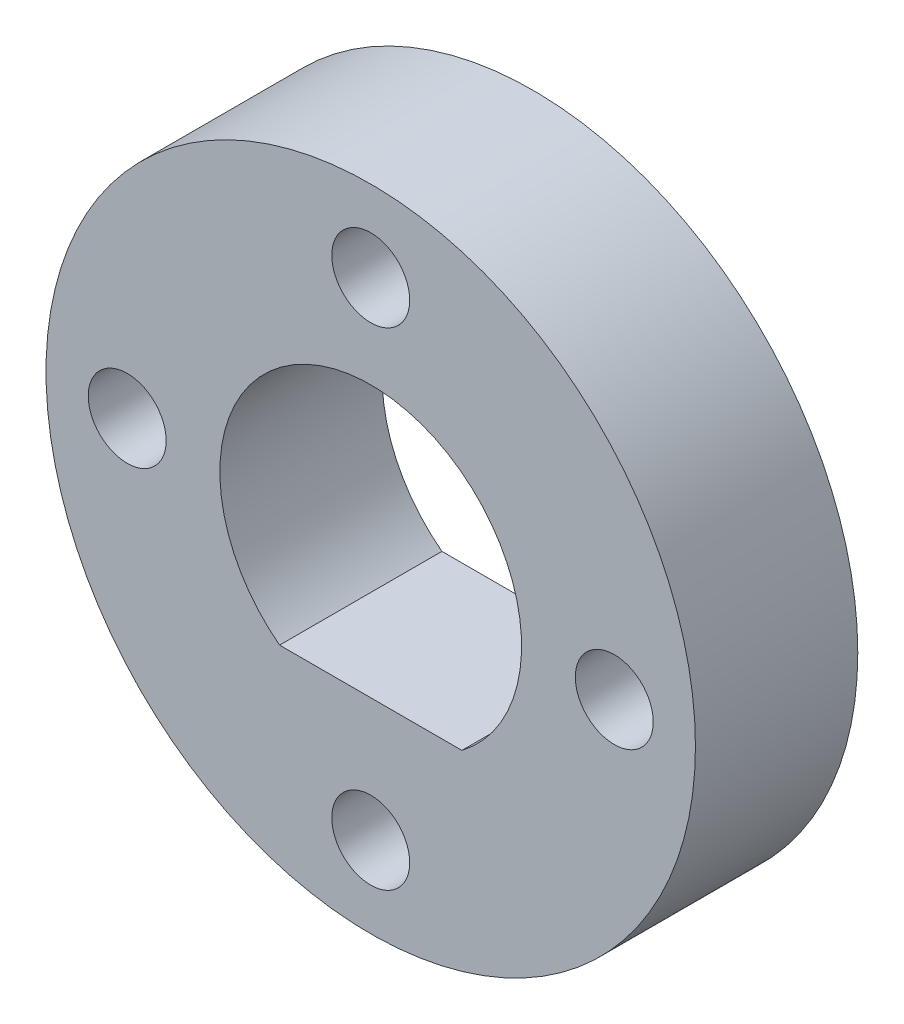
ISO-10303-21;
HEADER;
FILE_DESCRIPTION(('STEP AP214'),'2;1');
FILE_NAME('part.step','',(''),(''),'','','');
FILE_SCHEMA(('AUTOMOTIVE_DESIGN { 1 0 10303 214 1 1 1 1 }'));
ENDSEC;
DATA;
#1=APPLICATION_CONTEXT('core data for automotive mechanical design processes');
#2=APPLICATION_PROTOCOL_DEFINITION('international standard','automotive_design',2000,#1);
#3=PRODUCT_CONTEXT('',#1,'mechanical');
#4=PRODUCT('Part','Part','',(#3));
#5=PRODUCT_RELATED_PRODUCT_CATEGORY('part','',(#4));
#6=PRODUCT_DEFINITION_FORMATION('','',#4);
#7=PRODUCT_DEFINITION_CONTEXT('part definition',#1,'design');
#8=PRODUCT_DEFINITION('design','',#6,#7);
#9=PRODUCT_DEFINITION_SHAPE('','',#8);
#10=(LENGTH_UNIT() NAMED_UNIT(*) SI_UNIT(.MILLI.,.METRE.));
#11=(NAMED_UNIT(*) PLANE_ANGLE_UNIT() SI_UNIT($,.RADIAN.));
#12=(NAMED_UNIT(*) SI_UNIT($,.STERADIAN.) SOLID_ANGLE_UNIT());
#13=UNCERTAINTY_MEASURE_WITH_UNIT(LENGTH_MEASURE(1.E-05),#10,'distance_accuracy_value','');
#14=(GEOMETRIC_REPRESENTATION_CONTEXT(3) GLOBAL_UNCERTAINTY_ASSIGNED_CONTEXT((#13)) GLOBAL_UNIT_ASSIGNED_CONTEXT((#10,
#11,#12)) REPRESENTATION_CONTEXT('',''));
#15=CARTESIAN_POINT('',(0.,0.,0.));
#16=DIRECTION('',(0.,0.,1.));
#17=DIRECTION('',(1.,0.,0.));
#18=AXIS2_PLACEMENT_3D('',#15,#16,#17);
#19=CARTESIAN_POINT('',(0.,0.,3.175));
#20=DIRECTION('',(0.,0.,1.));
#21=DIRECTION('',(1.,0.,0.));
#22=AXIS2_PLACEMENT_3D('',#19,#20,#21);
#23=PLANE('',#22);
#24=CARTESIAN_POINT('',(0.,-4.7625,3.175));
#25=DIRECTION('',(0.,0.,1.));
#26=DIRECTION('',(1.,0.,0.));
#27=AXIS2_PLACEMENT_3D('',#24,#25,#26);
#28=CIRCLE('',#27,0.762);
#29=CARTESIAN_POINT('',(0.761999999999966,-4.7625,3.175));
#30=VERTEX_POINT('',#29);
#31=EDGE_CURVE('E87',#30,#30,#28,.T.);
#32=ORIENTED_EDGE('',*,*,#31,.F.);
#33=EDGE_LOOP('',(#32));
#34=FACE_BOUND('',#33,.T.);
#35=CARTESIAN_POINT('',(0.,4.7625,3.175));
#36=DIRECTION('',(0.,0.,1.));
#37=DIRECTION('',(1.,0.,0.));
#38=AXIS2_PLACEMENT_3D('',#35,#36,#37);
#39=CIRCLE('',#38,0.762);
#40=CARTESIAN_POINT('',(0.762,4.7625,3.175));
#41=VERTEX_POINT('',#40);
#42=EDGE_CURVE('E71',#41,#41,#39,.T.);
#43=ORIENTED_EDGE('',*,*,#42,.F.);
#44=EDGE_LOOP('',(#43));
#45=FACE_BOUND('',#44,.T.);
#46=CARTESIAN_POINT('',(0.,0.,3.175));
#47=DIRECTION('',(0.,0.,1.));
#48=DIRECTION('',(1.,0.,0.));
#49=AXIS2_PLACEMENT_3D('',#46,#47,#48);
#50=CIRCLE('',#49,6.35);
#51=CARTESIAN_POINT('',(6.35,0.,3.175));
#52=VERTEX_POINT('',#51);
#53=EDGE_CURVE('E11',#52,#52,#50,.T.);
#54=ORIENTED_EDGE('',*,*,#53,.T.);
#55=EDGE_LOOP('',(#54));
#56=FACE_BOUND('',#55,.T.);
#57=DIRECTION('',(1.,0.,0.));
#58=VECTOR('',#57,1.);
#59=CARTESIAN_POINT('',(-1.78258785230911,-2.35077,3.175));
#60=LINE('',#59,#58);
#61=CARTESIAN_POINT('',(-1.78258785230911,-2.35077,3.175));
#62=VERTEX_POINT('',#61);
#63=CARTESIAN_POINT('',(1.78258785230911,-2.35077,3.175));
#64=VERTEX_POINT('',#63);
#65=EDGE_CURVE('E77',#62,#64,#60,.T.);
#66=ORIENTED_EDGE('',*,*,#65,.F.);
#67=CARTESIAN_POINT('',(0.,0.,3.175));
#68=DIRECTION('',(0.,0.,1.));
#69=DIRECTION('',(1.,0.,0.));
#70=AXIS2_PLACEMENT_3D('',#67,#68,#69);
#71=CIRCLE('',#70,2.95021);
#72=EDGE_CURVE('E63',#64,#62,#71,.T.);
#73=ORIENTED_EDGE('',*,*,#72,.F.);
#74=EDGE_LOOP('',(#66,#73));
#75=FACE_BOUND('',#74,.T.);
#76=CARTESIAN_POINT('',(4.7625,0.,3.175));
#77=DIRECTION('',(0.,0.,1.));
#78=DIRECTION('',(1.,0.,0.));
#79=AXIS2_PLACEMENT_3D('',#76,#77,#78);
#80=CIRCLE('',#79,0.761999999999999);
#81=CARTESIAN_POINT('',(5.5245,0.,3.175));
#82=VERTEX_POINT('',#81);
#83=EDGE_CURVE('E82',#82,#82,#80,.T.);
#84=ORIENTED_EDGE('',*,*,#83,.F.);
#85=EDGE_LOOP('',(#84));
#86=FACE_BOUND('',#85,.T.);
#87=CARTESIAN_POINT('',(-4.7625,0.,3.175));
#88=DIRECTION('',(0.,0.,1.));
#89=DIRECTION('',(1.,0.,0.));
#90=AXIS2_PLACEMENT_3D('',#87,#88,#89);
#91=CIRCLE('',#90,0.761999999999999);
#92=CARTESIAN_POINT('',(-4.0005,0.,3.175));
#93=VERTEX_POINT('',#92);
#94=EDGE_CURVE('E93',#93,#93,#91,.T.);
#95=ORIENTED_EDGE('',*,*,#94,.F.);
#96=EDGE_LOOP('',(#95));
#97=FACE_BOUND('',#96,.T.);
#98=ADVANCED_FACE('F31',(#34,#45,#56,#75,#86,#97),#23,.T.);
#99=CARTESIAN_POINT('',(0.,0.,0.));
#100=DIRECTION('',(0.,0.,1.));
#101=DIRECTION('',(1.,0.,0.));
#102=AXIS2_PLACEMENT_3D('',#99,#100,#101);
#103=PLANE('',#102);
#104=CARTESIAN_POINT('',(0.,-4.7625,0.));
#105=DIRECTION('',(0.,0.,1.));
#106=DIRECTION('',(1.,0.,0.));
#107=AXIS2_PLACEMENT_3D('',#104,#105,#106);
#108=CIRCLE('',#107,0.762);
#109=CARTESIAN_POINT('',(0.761999999999966,-4.7625,0.));
#110=VERTEX_POINT('',#109);
#111=EDGE_CURVE('E90',#110,#110,#108,.T.);
#112=ORIENTED_EDGE('',*,*,#111,.T.);
#113=EDGE_LOOP('',(#112));
#114=FACE_BOUND('',#113,.T.);
#115=CARTESIAN_POINT('',(0.,4.7625,0.));
#116=DIRECTION('',(0.,0.,1.));
#117=DIRECTION('',(1.,0.,0.));
#118=AXIS2_PLACEMENT_3D('',#115,#116,#117);
#119=CIRCLE('',#118,0.762);
#120=CARTESIAN_POINT('',(0.762,4.7625,0.));
#121=VERTEX_POINT('',#120);
#122=EDGE_CURVE('E74',#121,#121,#119,.T.);
#123=ORIENTED_EDGE('',*,*,#122,.T.);
#124=EDGE_LOOP('',(#123));
#125=FACE_BOUND('',#124,.T.);
#126=CARTESIAN_POINT('',(0.,0.,0.));
#127=DIRECTION('',(0.,0.,1.));
#128=DIRECTION('',(1.,0.,0.));
#129=AXIS2_PLACEMENT_3D('',#126,#127,#128);
#130=CIRCLE('',#129,6.35);
#131=CARTESIAN_POINT('',(6.35,0.,0.));
#132=VERTEX_POINT('',#131);
#133=EDGE_CURVE('E35',#132,#132,#130,.T.);
#134=ORIENTED_EDGE('',*,*,#133,.F.);
#135=EDGE_LOOP('',(#134));
#136=FACE_BOUND('',#135,.T.);
#137=CARTESIAN_POINT('',(0.,0.,0.));
#138=DIRECTION('',(0.,0.,1.));
#139=DIRECTION('',(1.,0.,0.));
#140=AXIS2_PLACEMENT_3D('',#137,#138,#139);
#141=CIRCLE('',#140,2.95021);
#142=CARTESIAN_POINT('',(1.78258785230911,-2.35077,0.));
#143=VERTEX_POINT('',#142);
#144=CARTESIAN_POINT('',(-1.78258785230911,-2.35077,0.));
#145=VERTEX_POINT('',#144);
#146=EDGE_CURVE('E53',#143,#145,#141,.T.);
#147=ORIENTED_EDGE('',*,*,#146,.T.);
#148=DIRECTION('',(1.,0.,0.));
#149=VECTOR('',#148,1.);
#150=CARTESIAN_POINT('',(-1.78258785230911,-2.35077,0.));
#151=LINE('',#150,#149);
#152=EDGE_CURVE('E59',#145,#143,#151,.T.);
#153=ORIENTED_EDGE('',*,*,#152,.T.);
#154=EDGE_LOOP('',(#147,#153));
#155=FACE_BOUND('',#154,.T.);
#156=CARTESIAN_POINT('',(4.7625,0.,0.));
#157=DIRECTION('',(0.,0.,1.));
#158=DIRECTION('',(1.,0.,0.));
#159=AXIS2_PLACEMENT_3D('',#156,#157,#158);
#160=CIRCLE('',#159,0.761999999999999);
#161=CARTESIAN_POINT('',(5.5245,0.,0.));
#162=VERTEX_POINT('',#161);
#163=EDGE_CURVE('E84',#162,#162,#160,.T.);
#164=ORIENTED_EDGE('',*,*,#163,.T.);
#165=EDGE_LOOP('',(#164));
#166=FACE_BOUND('',#165,.T.);
#167=CARTESIAN_POINT('',(-4.7625,0.,0.));
#168=DIRECTION('',(0.,0.,1.));
#169=DIRECTION('',(1.,0.,0.));
#170=AXIS2_PLACEMENT_3D('',#167,#168,#169);
#171=CIRCLE('',#170,0.761999999999999);
#172=CARTESIAN_POINT('',(-4.0005,0.,0.));
#173=VERTEX_POINT('',#172);
#174=EDGE_CURVE('E96',#173,#173,#171,.T.);
#175=ORIENTED_EDGE('',*,*,#174,.T.);
#176=EDGE_LOOP('',(#175));
#177=FACE_BOUND('',#176,.T.);
#178=ADVANCED_FACE('F69',(#114,#125,#136,#155,#166,#177),#103,.F.);
#179=CARTESIAN_POINT('',(0.,0.,3.175));
#180=DIRECTION('',(0.,0.,-1.));
#181=DIRECTION('',(-1.,0.,0.));
#182=AXIS2_PLACEMENT_3D('',#179,#180,#181);
#183=CYLINDRICAL_SURFACE('',#182,6.35);
#184=ORIENTED_EDGE('',*,*,#53,.F.);
#185=EDGE_LOOP('',(#184));
#186=FACE_BOUND('',#185,.T.);
#187=ORIENTED_EDGE('',*,*,#133,.T.);
#188=EDGE_LOOP('',(#187));
#189=FACE_BOUND('',#188,.T.);
#190=ADVANCED_FACE('F33',(#186,#189),#183,.T.);
#191=CARTESIAN_POINT('',(0.,0.,3.175));
#192=DIRECTION('',(0.,0.,-1.));
#193=DIRECTION('',(-1.,0.,0.));
#194=AXIS2_PLACEMENT_3D('',#191,#192,#193);
#195=CYLINDRICAL_SURFACE('',#194,2.95021);
#196=ORIENTED_EDGE('',*,*,#146,.F.);
#197=DIRECTION('',(0.,0.,-1.));
#198=VECTOR('',#197,1.);
#199=CARTESIAN_POINT('',(1.78258785230911,-2.35077,3.175));
#200=LINE('',#199,#198);
#201=EDGE_CURVE('E61',#64,#143,#200,.T.);
#202=ORIENTED_EDGE('',*,*,#201,.F.);
#203=ORIENTED_EDGE('',*,*,#72,.T.);
#204=DIRECTION('',(0.,0.,-1.));
#205=VECTOR('',#204,1.);
#206=CARTESIAN_POINT('',(-1.78258785230911,-2.35077,3.175));
#207=LINE('',#206,#205);
#208=EDGE_CURVE('E46',#62,#145,#207,.T.);
#209=ORIENTED_EDGE('',*,*,#208,.T.);
#210=EDGE_LOOP('',(#196,#202,#203,#209));
#211=FACE_BOUND('',#210,.T.);
#212=ADVANCED_FACE('F65',(#211),#195,.F.);
#213=CARTESIAN_POINT('',(-1.78258785230911,-2.35077,3.175));
#214=DIRECTION('',(0.,1.,0.));
#215=DIRECTION('',(0.,0.,1.));
#216=AXIS2_PLACEMENT_3D('',#213,#214,#215);
#217=PLANE('',#216);
#218=ORIENTED_EDGE('',*,*,#152,.F.);
#219=ORIENTED_EDGE('',*,*,#208,.F.);
#220=ORIENTED_EDGE('',*,*,#65,.T.);
#221=ORIENTED_EDGE('',*,*,#201,.T.);
#222=EDGE_LOOP('',(#218,#219,#220,#221));
#223=FACE_BOUND('',#222,.T.);
#224=ADVANCED_FACE('F60',(#223),#217,.T.);
#225=CARTESIAN_POINT('',(0.,4.7625,3.175));
#226=DIRECTION('',(0.,0.,-1.));
#227=DIRECTION('',(-1.,0.,0.));
#228=AXIS2_PLACEMENT_3D('',#225,#226,#227);
#229=CYLINDRICAL_SURFACE('',#228,0.762);
#230=ORIENTED_EDGE('',*,*,#42,.T.);
#231=EDGE_LOOP('',(#230));
#232=FACE_BOUND('',#231,.T.);
#233=ORIENTED_EDGE('',*,*,#122,.F.);
#234=EDGE_LOOP('',(#233));
#235=FACE_BOUND('',#234,.T.);
#236=ADVANCED_FACE('F119',(#232,#235),#229,.F.);
#237=CARTESIAN_POINT('',(4.7625,0.,3.175));
#238=DIRECTION('',(0.,0.,-1.));
#239=DIRECTION('',(-1.,0.,0.));
#240=AXIS2_PLACEMENT_3D('',#237,#238,#239);
#241=CYLINDRICAL_SURFACE('',#240,0.761999999999999);
#242=ORIENTED_EDGE('',*,*,#83,.T.);
#243=EDGE_LOOP('',(#242));
#244=FACE_BOUND('',#243,.T.);
#245=ORIENTED_EDGE('',*,*,#163,.F.);
#246=EDGE_LOOP('',(#245));
#247=FACE_BOUND('',#246,.T.);
#248=ADVANCED_FACE('F122',(#244,#247),#241,.F.);
#249=CARTESIAN_POINT('',(0.,-4.7625,3.175));
#250=DIRECTION('',(0.,0.,-1.));
#251=DIRECTION('',(-1.,0.,0.));
#252=AXIS2_PLACEMENT_3D('',#249,#250,#251);
#253=CYLINDRICAL_SURFACE('',#252,0.762);
#254=ORIENTED_EDGE('',*,*,#31,.T.);
#255=EDGE_LOOP('',(#254));
#256=FACE_BOUND('',#255,.T.);
#257=ORIENTED_EDGE('',*,*,#111,.F.);
#258=EDGE_LOOP('',(#257));
#259=FACE_BOUND('',#258,.T.);
#260=ADVANCED_FACE('F126',(#256,#259),#253,.F.);
#261=CARTESIAN_POINT('',(-4.7625,0.,3.175));
#262=DIRECTION('',(0.,0.,-1.));
#263=DIRECTION('',(-1.,0.,0.));
#264=AXIS2_PLACEMENT_3D('',#261,#262,#263);
#265=CYLINDRICAL_SURFACE('',#264,0.761999999999999);
#266=ORIENTED_EDGE('',*,*,#94,.T.);
#267=EDGE_LOOP('',(#266));
#268=FACE_BOUND('',#267,.T.);
#269=ORIENTED_EDGE('',*,*,#174,.F.);
#270=EDGE_LOOP('',(#269));
#271=FACE_BOUND('',#270,.T.);
#272=ADVANCED_FACE('F102',(#268,#271),#265,.F.);
#273=CLOSED_SHELL('',(#98,#178,#190,#212,#224,#236,#248,#260,#272));
#274=MANIFOLD_SOLID_BREP('B2',#273);
#275=ADVANCED_BREP_SHAPE_REPRESENTATION('',(#18,#274),#14);
#276=SHAPE_DEFINITION_REPRESENTATION(#9,#275);
ENDSEC;
END-ISO-10303-21;
